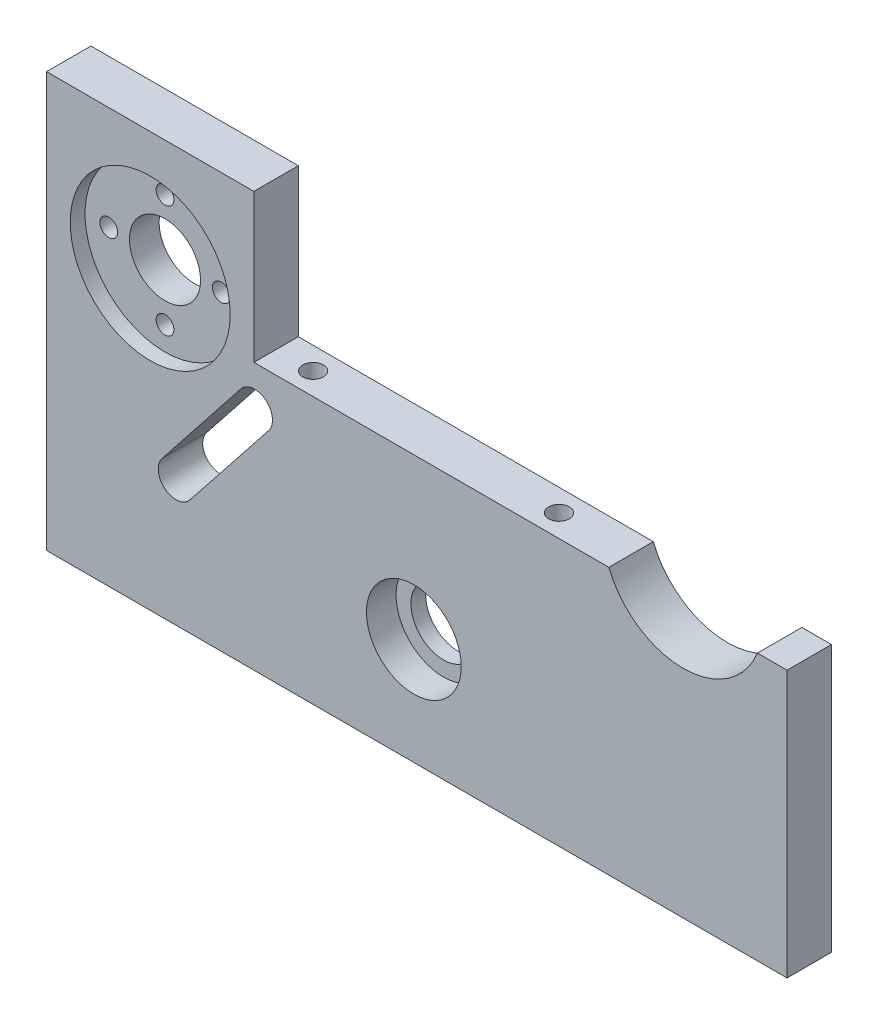
ISO-10303-21;
HEADER;
FILE_DESCRIPTION(('STEP AP214'),'2;1');
FILE_NAME('part.step','',(''),(''),'','','');
FILE_SCHEMA(('AUTOMOTIVE_DESIGN { 1 0 10303 214 1 1 1 1 }'));
ENDSEC;
DATA;
#1=APPLICATION_CONTEXT('core data for automotive mechanical design processes');
#2=APPLICATION_PROTOCOL_DEFINITION('international standard','automotive_design',2000,#1);
#3=PRODUCT_CONTEXT('',#1,'mechanical');
#4=PRODUCT('Part','Part','',(#3));
#5=PRODUCT_RELATED_PRODUCT_CATEGORY('part','',(#4));
#6=PRODUCT_DEFINITION_FORMATION('','',#4);
#7=PRODUCT_DEFINITION_CONTEXT('part definition',#1,'design');
#8=PRODUCT_DEFINITION('design','',#6,#7);
#9=PRODUCT_DEFINITION_SHAPE('','',#8);
#10=(LENGTH_UNIT() NAMED_UNIT(*) SI_UNIT(.MILLI.,.METRE.));
#11=(NAMED_UNIT(*) PLANE_ANGLE_UNIT() SI_UNIT($,.RADIAN.));
#12=(NAMED_UNIT(*) SI_UNIT($,.STERADIAN.) SOLID_ANGLE_UNIT());
#13=UNCERTAINTY_MEASURE_WITH_UNIT(LENGTH_MEASURE(1.E-05),#10,'distance_accuracy_value','');
#14=(GEOMETRIC_REPRESENTATION_CONTEXT(3) GLOBAL_UNCERTAINTY_ASSIGNED_CONTEXT((#13)) GLOBAL_UNIT_ASSIGNED_CONTEXT((#10,
#11,#12)) REPRESENTATION_CONTEXT('',''));
#15=CARTESIAN_POINT('',(0.,0.,0.));
#16=DIRECTION('',(0.,0.,1.));
#17=DIRECTION('',(1.,0.,0.));
#18=AXIS2_PLACEMENT_3D('',#15,#16,#17);
#19=CARTESIAN_POINT('',(71.614420341394,12.6710526315789,7.5));
#20=DIRECTION('',(0.,-1.,0.));
#21=DIRECTION('',(1.,0.,0.));
#22=AXIS2_PLACEMENT_3D('',#19,#20,#21);
#23=PLANE('',#22);
#24=DIRECTION('',(-1.,0.,0.));
#25=VECTOR('',#24,1.);
#26=CARTESIAN_POINT('',(71.614420341394,12.6710526315789,0.));
#27=LINE('',#26,#25);
#28=CARTESIAN_POINT('',(71.614420341394,12.6710526315789,0.));
#29=VERTEX_POINT('',#28);
#30=CARTESIAN_POINT('',(66.614420341394,12.6710526315789,0.));
#31=VERTEX_POINT('',#30);
#32=EDGE_CURVE('E139',#29,#31,#27,.T.);
#33=ORIENTED_EDGE('',*,*,#32,.T.);
#34=DIRECTION('',(0.,0.,1.));
#35=VECTOR('',#34,1.);
#36=CARTESIAN_POINT('',(66.614420341394,12.6710526315789,-0.5));
#37=LINE('',#36,#35);
#38=CARTESIAN_POINT('',(66.614420341394,12.6710526315789,7.5));
#39=VERTEX_POINT('',#38);
#40=EDGE_CURVE('E125',#31,#39,#37,.T.);
#41=ORIENTED_EDGE('',*,*,#40,.T.);
#42=DIRECTION('',(-1.,0.,0.));
#43=VECTOR('',#42,1.);
#44=CARTESIAN_POINT('',(71.614420341394,12.6710526315789,7.5));
#45=LINE('',#44,#43);
#46=CARTESIAN_POINT('',(71.614420341394,12.6710526315789,7.5));
#47=VERTEX_POINT('',#46);
#48=EDGE_CURVE('E137',#47,#39,#45,.T.);
#49=ORIENTED_EDGE('',*,*,#48,.F.);
#50=DIRECTION('',(0.,0.,-1.));
#51=VECTOR('',#50,1.);
#52=CARTESIAN_POINT('',(71.614420341394,12.6710526315789,7.5));
#53=LINE('',#52,#51);
#54=EDGE_CURVE('E173',#47,#29,#53,.T.);
#55=ORIENTED_EDGE('',*,*,#54,.T.);
#56=EDGE_LOOP('',(#33,#41,#49,#55));
#57=FACE_BOUND('',#56,.T.);
#58=ADVANCED_FACE('F33',(#57),#23,.F.);
#59=CARTESIAN_POINT('',(-18.385579658606,37.671052631579,7.5));
#60=DIRECTION('',(0.,-1.,0.));
#61=DIRECTION('',(1.,0.,0.));
#62=AXIS2_PLACEMENT_3D('',#59,#60,#61);
#63=PLANE('',#62);
#64=DIRECTION('',(-1.,0.,0.));
#65=VECTOR('',#64,1.);
#66=CARTESIAN_POINT('',(-18.385579658606,37.671052631579,0.));
#67=LINE('',#66,#65);
#68=CARTESIAN_POINT('',(-18.385579658606,37.671052631579,0.));
#69=VERTEX_POINT('',#68);
#70=CARTESIAN_POINT('',(-53.385579658606,37.6710526315789,0.));
#71=VERTEX_POINT('',#70);
#72=EDGE_CURVE('E154',#69,#71,#67,.T.);
#73=ORIENTED_EDGE('',*,*,#72,.T.);
#74=DIRECTION('',(0.,0.,-1.));
#75=VECTOR('',#74,1.);
#76=CARTESIAN_POINT('',(-53.385579658606,37.6710526315789,7.5));
#77=LINE('',#76,#75);
#78=CARTESIAN_POINT('',(-53.385579658606,37.6710526315789,7.5));
#79=VERTEX_POINT('',#78);
#80=EDGE_CURVE('E181',#79,#71,#77,.T.);
#81=ORIENTED_EDGE('',*,*,#80,.F.);
#82=DIRECTION('',(-1.,0.,0.));
#83=VECTOR('',#82,1.);
#84=CARTESIAN_POINT('',(-18.385579658606,37.671052631579,7.5));
#85=LINE('',#84,#83);
#86=CARTESIAN_POINT('',(-18.385579658606,37.671052631579,7.5));
#87=VERTEX_POINT('',#86);
#88=EDGE_CURVE('E167',#87,#79,#85,.T.);
#89=ORIENTED_EDGE('',*,*,#88,.F.);
#90=DIRECTION('',(0.,0.,-1.));
#91=VECTOR('',#90,1.);
#92=CARTESIAN_POINT('',(-18.385579658606,37.671052631579,7.5));
#93=LINE('',#92,#91);
#94=EDGE_CURVE('E149',#87,#69,#93,.T.);
#95=ORIENTED_EDGE('',*,*,#94,.T.);
#96=EDGE_LOOP('',(#73,#81,#89,#95));
#97=FACE_BOUND('',#96,.T.);
#98=ADVANCED_FACE('F35',(#97),#63,.F.);
#99=CARTESIAN_POINT('',(-53.385579658606,37.6710526315789,7.5));
#100=DIRECTION('',(1.,0.,0.));
#101=DIRECTION('',(0.,0.,-1.));
#102=AXIS2_PLACEMENT_3D('',#99,#100,#101);
#103=PLANE('',#102);
#104=DIRECTION('',(0.,-1.,0.));
#105=VECTOR('',#104,1.);
#106=CARTESIAN_POINT('',(-53.385579658606,37.6710526315789,0.));
#107=LINE('',#106,#105);
#108=CARTESIAN_POINT('',(-53.385579658606,-32.3289473684211,0.));
#109=VERTEX_POINT('',#108);
#110=EDGE_CURVE('E157',#71,#109,#107,.T.);
#111=ORIENTED_EDGE('',*,*,#110,.T.);
#112=DIRECTION('',(0.,0.,-1.));
#113=VECTOR('',#112,1.);
#114=CARTESIAN_POINT('',(-53.385579658606,-32.3289473684211,7.5));
#115=LINE('',#114,#113);
#116=CARTESIAN_POINT('',(-53.385579658606,-32.3289473684211,7.5));
#117=VERTEX_POINT('',#116);
#118=EDGE_CURVE('E178',#117,#109,#115,.T.);
#119=ORIENTED_EDGE('',*,*,#118,.F.);
#120=DIRECTION('',(0.,-1.,0.));
#121=VECTOR('',#120,1.);
#122=CARTESIAN_POINT('',(-53.385579658606,37.6710526315789,7.5));
#123=LINE('',#122,#121);
#124=EDGE_CURVE('E215',#79,#117,#123,.T.);
#125=ORIENTED_EDGE('',*,*,#124,.F.);
#126=ORIENTED_EDGE('',*,*,#80,.T.);
#127=EDGE_LOOP('',(#111,#119,#125,#126));
#128=FACE_BOUND('',#127,.T.);
#129=ADVANCED_FACE('F259',(#128),#103,.F.);
#130=CARTESIAN_POINT('',(-53.385579658606,-32.3289473684211,7.5));
#131=DIRECTION('',(0.,1.,0.));
#132=DIRECTION('',(0.,0.,1.));
#133=AXIS2_PLACEMENT_3D('',#130,#131,#132);
#134=PLANE('',#133);
#135=CARTESIAN_POINT('',(-49.385579658606,-32.3289473684211,3.80027661688586));
#136=DIRECTION('',(0.,-1.,0.));
#137=DIRECTION('',(0.,0.,-1.));
#138=AXIS2_PLACEMENT_3D('',#135,#136,#137);
#139=CIRCLE('',#138,1.75);
#140=CARTESIAN_POINT('',(-49.385579658606,-32.3289473684211,2.05027661688586));
#141=VERTEX_POINT('',#140);
#142=EDGE_CURVE('E285',#141,#141,#139,.T.);
#143=ORIENTED_EDGE('',*,*,#142,.F.);
#144=EDGE_LOOP('',(#143));
#145=FACE_BOUND('',#144,.T.);
#146=CARTESIAN_POINT('',(-17.885579658606,-32.3289473684211,3.80027661688586));
#147=DIRECTION('',(0.,-1.,0.));
#148=DIRECTION('',(0.,0.,-1.));
#149=AXIS2_PLACEMENT_3D('',#146,#147,#148);
#150=CIRCLE('',#149,1.75);
#151=CARTESIAN_POINT('',(-17.885579658606,-32.3289473684211,2.05027661688586));
#152=VERTEX_POINT('',#151);
#153=EDGE_CURVE('E451',#152,#152,#150,.T.);
#154=ORIENTED_EDGE('',*,*,#153,.F.);
#155=EDGE_LOOP('',(#154));
#156=FACE_BOUND('',#155,.T.);
#157=CARTESIAN_POINT('',(36.114420341394,-32.3289473684211,3.80027661688586));
#158=DIRECTION('',(0.,-1.,0.));
#159=DIRECTION('',(0.,0.,-1.));
#160=AXIS2_PLACEMENT_3D('',#157,#158,#159);
#161=CIRCLE('',#160,1.75);
#162=CARTESIAN_POINT('',(36.114420341394,-32.3289473684211,2.05027661688586));
#163=VERTEX_POINT('',#162);
#164=EDGE_CURVE('E459',#163,#163,#161,.T.);
#165=ORIENTED_EDGE('',*,*,#164,.F.);
#166=EDGE_LOOP('',(#165));
#167=FACE_BOUND('',#166,.T.);
#168=CARTESIAN_POINT('',(67.614420341394,-32.3289473684211,3.80027661688586));
#169=DIRECTION('',(0.,-1.,0.));
#170=DIRECTION('',(0.,0.,-1.));
#171=AXIS2_PLACEMENT_3D('',#168,#169,#170);
#172=CIRCLE('',#171,1.75);
#173=CARTESIAN_POINT('',(67.614420341394,-32.3289473684211,2.05027661688587));
#174=VERTEX_POINT('',#173);
#175=EDGE_CURVE('E465',#174,#174,#172,.T.);
#176=ORIENTED_EDGE('',*,*,#175,.F.);
#177=EDGE_LOOP('',(#176));
#178=FACE_BOUND('',#177,.T.);
#179=DIRECTION('',(1.,0.,0.));
#180=VECTOR('',#179,1.);
#181=CARTESIAN_POINT('',(-53.385579658606,-32.3289473684211,0.));
#182=LINE('',#181,#180);
#183=CARTESIAN_POINT('',(71.614420341394,-32.3289473684211,0.));
#184=VERTEX_POINT('',#183);
#185=EDGE_CURVE('E159',#109,#184,#182,.T.);
#186=ORIENTED_EDGE('',*,*,#185,.T.);
#187=DIRECTION('',(0.,0.,-1.));
#188=VECTOR('',#187,1.);
#189=CARTESIAN_POINT('',(71.614420341394,-32.3289473684211,7.5));
#190=LINE('',#189,#188);
#191=CARTESIAN_POINT('',(71.614420341394,-32.3289473684211,7.5));
#192=VERTEX_POINT('',#191);
#193=EDGE_CURVE('E175',#192,#184,#190,.T.);
#194=ORIENTED_EDGE('',*,*,#193,.F.);
#195=DIRECTION('',(1.,0.,0.));
#196=VECTOR('',#195,1.);
#197=CARTESIAN_POINT('',(-53.385579658606,-32.3289473684211,7.5));
#198=LINE('',#197,#196);
#199=EDGE_CURVE('E216',#117,#192,#198,.T.);
#200=ORIENTED_EDGE('',*,*,#199,.F.);
#201=ORIENTED_EDGE('',*,*,#118,.T.);
#202=EDGE_LOOP('',(#186,#194,#200,#201));
#203=FACE_BOUND('',#202,.T.);
#204=ADVANCED_FACE('F221',(#145,#156,#167,#178,#203),#134,.F.);
#205=CARTESIAN_POINT('',(71.614420341394,-32.3289473684211,7.5));
#206=DIRECTION('',(-1.,0.,0.));
#207=DIRECTION('',(0.,0.,1.));
#208=AXIS2_PLACEMENT_3D('',#205,#206,#207);
#209=PLANE('',#208);
#210=DIRECTION('',(0.,1.,0.));
#211=VECTOR('',#210,1.);
#212=CARTESIAN_POINT('',(71.614420341394,-32.3289473684211,0.));
#213=LINE('',#212,#211);
#214=EDGE_CURVE('E161',#184,#29,#213,.T.);
#215=ORIENTED_EDGE('',*,*,#214,.T.);
#216=ORIENTED_EDGE('',*,*,#54,.F.);
#217=DIRECTION('',(0.,1.,0.));
#218=VECTOR('',#217,1.);
#219=CARTESIAN_POINT('',(71.614420341394,-32.3289473684211,7.5));
#220=LINE('',#219,#218);
#221=EDGE_CURVE('E144',#192,#47,#220,.T.);
#222=ORIENTED_EDGE('',*,*,#221,.F.);
#223=ORIENTED_EDGE('',*,*,#193,.T.);
#224=EDGE_LOOP('',(#215,#216,#222,#223));
#225=FACE_BOUND('',#224,.T.);
#226=ADVANCED_FACE('F225',(#225),#209,.F.);
#227=CARTESIAN_POINT('',(-12.135579658606,12.6710526315789,3.75));
#228=DIRECTION('',(0.,1.,0.));
#229=DIRECTION('',(-1.,0.,0.));
#230=AXIS2_PLACEMENT_3D('',#227,#228,#229);
#231=CIRCLE('',#230,1.75);
#232=CARTESIAN_POINT('',(-13.885579658606,12.6710526315789,3.75));
#233=VERTEX_POINT('',#232);
#234=EDGE_CURVE('E274',#233,#233,#231,.T.);
#235=ORIENTED_EDGE('',*,*,#234,.F.);
#236=EDGE_LOOP('',(#235));
#237=FACE_BOUND('',#236,.T.);
#238=CARTESIAN_POINT('',(29.364420341394,12.6710526315789,3.75));
#239=DIRECTION('',(0.,1.,0.));
#240=DIRECTION('',(-1.,0.,0.));
#241=AXIS2_PLACEMENT_3D('',#238,#239,#240);
#242=CIRCLE('',#241,1.75);
#243=CARTESIAN_POINT('',(27.614420341394,12.6710526315789,3.75));
#244=VERTEX_POINT('',#243);
#245=EDGE_CURVE('E277',#244,#244,#242,.T.);
#246=ORIENTED_EDGE('',*,*,#245,.F.);
#247=EDGE_LOOP('',(#246));
#248=FACE_BOUND('',#247,.T.);
#249=CARTESIAN_POINT('',(41.5345479334251,12.6710526315789,7.5));
#250=VERTEX_POINT('',#249);
#251=CARTESIAN_POINT('',(-18.385579658606,12.6710526315789,7.5));
#252=VERTEX_POINT('',#251);
#253=EDGE_CURVE('E147',#250,#252,#45,.T.);
#254=ORIENTED_EDGE('',*,*,#253,.F.);
#255=DIRECTION('',(0.,0.,1.));
#256=VECTOR('',#255,1.);
#257=CARTESIAN_POINT('',(41.5345479334251,12.6710526315789,-0.5));
#258=LINE('',#257,#256);
#259=CARTESIAN_POINT('',(41.5345479334251,12.6710526315789,0.));
#260=VERTEX_POINT('',#259);
#261=EDGE_CURVE('E127',#260,#250,#258,.T.);
#262=ORIENTED_EDGE('',*,*,#261,.F.);
#263=CARTESIAN_POINT('',(-18.385579658606,12.6710526315789,0.));
#264=VERTEX_POINT('',#263);
#265=EDGE_CURVE('E163',#260,#264,#27,.T.);
#266=ORIENTED_EDGE('',*,*,#265,.T.);
#267=DIRECTION('',(0.,0.,-1.));
#268=VECTOR('',#267,1.);
#269=CARTESIAN_POINT('',(-18.385579658606,12.6710526315789,7.5));
#270=LINE('',#269,#268);
#271=EDGE_CURVE('E170',#252,#264,#270,.T.);
#272=ORIENTED_EDGE('',*,*,#271,.F.);
#273=EDGE_LOOP('',(#254,#262,#266,#272));
#274=FACE_BOUND('',#273,.T.);
#275=ADVANCED_FACE('F229',(#237,#248,#274),#23,.F.);
#276=CARTESIAN_POINT('',(-18.385579658606,12.6710526315789,7.5));
#277=DIRECTION('',(-1.,0.,0.));
#278=DIRECTION('',(0.,-1.,0.));
#279=AXIS2_PLACEMENT_3D('',#276,#277,#278);
#280=PLANE('',#279);
#281=DIRECTION('',(0.,1.,0.));
#282=VECTOR('',#281,1.);
#283=CARTESIAN_POINT('',(-18.385579658606,12.6710526315789,0.));
#284=LINE('',#283,#282);
#285=EDGE_CURVE('E165',#264,#69,#284,.T.);
#286=ORIENTED_EDGE('',*,*,#285,.T.);
#287=ORIENTED_EDGE('',*,*,#94,.F.);
#288=DIRECTION('',(0.,1.,0.));
#289=VECTOR('',#288,1.);
#290=CARTESIAN_POINT('',(-18.385579658606,12.6710526315789,7.5));
#291=LINE('',#290,#289);
#292=EDGE_CURVE('E146',#252,#87,#291,.T.);
#293=ORIENTED_EDGE('',*,*,#292,.F.);
#294=ORIENTED_EDGE('',*,*,#271,.T.);
#295=EDGE_LOOP('',(#286,#287,#293,#294));
#296=FACE_BOUND('',#295,.T.);
#297=ADVANCED_FACE('F264',(#296),#280,.F.);
#298=CARTESIAN_POINT('',(0.,0.,7.5));
#299=DIRECTION('',(0.,0.,1.));
#300=DIRECTION('',(1.,0.,0.));
#301=AXIS2_PLACEMENT_3D('',#298,#299,#300);
#302=PLANE('',#301);
#303=CARTESIAN_POINT('',(-35.885579658606,17.671052631579,7.5));
#304=DIRECTION('',(0.,0.,1.));
#305=DIRECTION('',(1.,0.,0.));
#306=AXIS2_PLACEMENT_3D('',#303,#304,#305);
#307=CIRCLE('',#306,13.5);
#308=CARTESIAN_POINT('',(-22.385579658606,17.671052631579,7.5));
#309=VERTEX_POINT('',#308);
#310=EDGE_CURVE('E293',#309,#309,#307,.T.);
#311=ORIENTED_EDGE('',*,*,#310,.F.);
#312=EDGE_LOOP('',(#311));
#313=FACE_BOUND('',#312,.T.);
#314=CARTESIAN_POINT('',(8.61442034139401,-14.3289473684211,7.5));
#315=DIRECTION('',(0.,0.,1.));
#316=DIRECTION('',(1.,0.,0.));
#317=AXIS2_PLACEMENT_3D('',#314,#315,#316);
#318=CIRCLE('',#317,8.);
#319=CARTESIAN_POINT('',(16.614420341394,-14.3289473684211,7.5));
#320=VERTEX_POINT('',#319);
#321=EDGE_CURVE('E330',#320,#320,#318,.T.);
#322=ORIENTED_EDGE('',*,*,#321,.F.);
#323=EDGE_LOOP('',(#322));
#324=FACE_BOUND('',#323,.T.);
#325=CARTESIAN_POINT('',(54.0744841374096,17.671052631579,7.5));
#326=DIRECTION('',(0.,0.,1.));
#327=DIRECTION('',(-1.,0.,0.));
#328=AXIS2_PLACEMENT_3D('',#325,#326,#327);
#329=CIRCLE('',#328,13.5);
#330=EDGE_CURVE('E122',#250,#39,#329,.T.);
#331=ORIENTED_EDGE('',*,*,#330,.F.);
#332=ORIENTED_EDGE('',*,*,#253,.T.);
#333=ORIENTED_EDGE('',*,*,#292,.T.);
#334=ORIENTED_EDGE('',*,*,#88,.T.);
#335=ORIENTED_EDGE('',*,*,#124,.T.);
#336=ORIENTED_EDGE('',*,*,#199,.T.);
#337=ORIENTED_EDGE('',*,*,#221,.T.);
#338=ORIENTED_EDGE('',*,*,#48,.T.);
#339=EDGE_LOOP('',(#331,#332,#333,#334,#335,#336,#337,#338));
#340=FACE_BOUND('',#339,.T.);
#341=CARTESIAN_POINT('',(-18.2462864107044,5.81780585686629,7.5));
#342=DIRECTION('',(0.,0.,1.));
#343=DIRECTION('',(-1.,0.,0.));
#344=AXIS2_PLACEMENT_3D('',#341,#342,#343);
#345=CIRCLE('',#344,3.);
#346=CARTESIAN_POINT('',(-15.8930396359917,3.95709910476791,7.5));
#347=VERTEX_POINT('',#346);
#348=CARTESIAN_POINT('',(-20.599533185417,7.67851260896467,7.5));
#349=VERTEX_POINT('',#348);
#350=EDGE_CURVE('E48',#347,#349,#345,.T.);
#351=ORIENTED_EDGE('',*,*,#350,.F.);
#352=DIRECTION('',(0.620235584032793,0.784415591570884,0.));
#353=VECTOR('',#352,1.);
#354=CARTESIAN_POINT('',(-15.8930396359917,3.95709910476791,7.5));
#355=LINE('',#354,#353);
#356=CARTESIAN_POINT('',(-29.171626131795,-12.8364073458068,7.5));
#357=VERTEX_POINT('',#356);
#358=EDGE_CURVE('E204',#357,#347,#355,.T.);
#359=ORIENTED_EDGE('',*,*,#358,.F.);
#360=CARTESIAN_POINT('',(-31.5248729065076,-10.9757005937084,7.5));
#361=DIRECTION('',(0.,0.,1.));
#362=DIRECTION('',(1.,0.,0.));
#363=AXIS2_PLACEMENT_3D('',#360,#361,#362);
#364=CIRCLE('',#363,3.);
#365=CARTESIAN_POINT('',(-33.8781196812203,-9.11499384161005,7.5));
#366=VERTEX_POINT('',#365);
#367=EDGE_CURVE('E237',#366,#357,#364,.T.);
#368=ORIENTED_EDGE('',*,*,#367,.F.);
#369=DIRECTION('',(-0.620235584032793,-0.784415591570884,0.));
#370=VECTOR('',#369,1.);
#371=CARTESIAN_POINT('',(-20.599533185417,7.67851260896467,7.5));
#372=LINE('',#371,#370);
#373=EDGE_CURVE('E235',#349,#366,#372,.T.);
#374=ORIENTED_EDGE('',*,*,#373,.F.);
#375=EDGE_LOOP('',(#351,#359,#368,#374));
#376=FACE_BOUND('',#375,.T.);
#377=ADVANCED_FACE('F141',(#313,#324,#340,#376),#302,.T.);
#378=CARTESIAN_POINT('',(0.,0.,0.));
#379=DIRECTION('',(0.,0.,1.));
#380=DIRECTION('',(1.,0.,0.));
#381=AXIS2_PLACEMENT_3D('',#378,#379,#380);
#382=PLANE('',#381);
#383=CARTESIAN_POINT('',(-26.385579658606,17.671052631579,0.));
#384=DIRECTION('',(0.,0.,-1.));
#385=DIRECTION('',(-1.,0.,0.));
#386=AXIS2_PLACEMENT_3D('',#383,#384,#385);
#387=CIRCLE('',#386,1.5);
#388=CARTESIAN_POINT('',(-27.885579658606,17.671052631579,0.));
#389=VERTEX_POINT('',#388);
#390=EDGE_CURVE('E300',#389,#389,#387,.T.);
#391=ORIENTED_EDGE('',*,*,#390,.F.);
#392=EDGE_LOOP('',(#391));
#393=FACE_BOUND('',#392,.T.);
#394=CARTESIAN_POINT('',(-35.885579658606,17.671052631579,0.));
#395=DIRECTION('',(0.,0.,-1.));
#396=DIRECTION('',(-1.,0.,0.));
#397=AXIS2_PLACEMENT_3D('',#394,#395,#396);
#398=CIRCLE('',#397,6.);
#399=CARTESIAN_POINT('',(-41.885579658606,17.671052631579,0.));
#400=VERTEX_POINT('',#399);
#401=EDGE_CURVE('E313',#400,#400,#398,.T.);
#402=ORIENTED_EDGE('',*,*,#401,.F.);
#403=EDGE_LOOP('',(#402));
#404=FACE_BOUND('',#403,.T.);
#405=CARTESIAN_POINT('',(-35.885579658606,8.17105263157895,0.));
#406=DIRECTION('',(0.,0.,-1.));
#407=DIRECTION('',(-1.,0.,0.));
#408=AXIS2_PLACEMENT_3D('',#405,#406,#407);
#409=CIRCLE('',#408,1.5);
#410=CARTESIAN_POINT('',(-37.385579658606,8.17105263157895,0.));
#411=VERTEX_POINT('',#410);
#412=EDGE_CURVE('E309',#411,#411,#409,.T.);
#413=ORIENTED_EDGE('',*,*,#412,.F.);
#414=EDGE_LOOP('',(#413));
#415=FACE_BOUND('',#414,.T.);
#416=CARTESIAN_POINT('',(-45.385579658606,17.671052631579,0.));
#417=DIRECTION('',(0.,0.,-1.));
#418=DIRECTION('',(-1.,0.,0.));
#419=AXIS2_PLACEMENT_3D('',#416,#417,#418);
#420=CIRCLE('',#419,1.5);
#421=CARTESIAN_POINT('',(-46.885579658606,17.671052631579,0.));
#422=VERTEX_POINT('',#421);
#423=EDGE_CURVE('E312',#422,#422,#420,.T.);
#424=ORIENTED_EDGE('',*,*,#423,.F.);
#425=EDGE_LOOP('',(#424));
#426=FACE_BOUND('',#425,.T.);
#427=CARTESIAN_POINT('',(-35.8855796586061,27.171052631579,0.));
#428=DIRECTION('',(0.,0.,-1.));
#429=DIRECTION('',(-1.,0.,0.));
#430=AXIS2_PLACEMENT_3D('',#427,#428,#429);
#431=CIRCLE('',#430,1.5);
#432=CARTESIAN_POINT('',(-37.3855796586061,27.171052631579,0.));
#433=VERTEX_POINT('',#432);
#434=EDGE_CURVE('E304',#433,#433,#431,.T.);
#435=ORIENTED_EDGE('',*,*,#434,.F.);
#436=EDGE_LOOP('',(#435));
#437=FACE_BOUND('',#436,.T.);
#438=CARTESIAN_POINT('',(8.61442034139401,-14.3289473684211,0.));
#439=DIRECTION('',(0.,0.,-1.));
#440=DIRECTION('',(-1.,0.,0.));
#441=AXIS2_PLACEMENT_3D('',#438,#439,#440);
#442=CIRCLE('',#441,5.5);
#443=CARTESIAN_POINT('',(3.11442034139401,-14.3289473684211,0.));
#444=VERTEX_POINT('',#443);
#445=EDGE_CURVE('E303',#444,#444,#442,.T.);
#446=ORIENTED_EDGE('',*,*,#445,.F.);
#447=EDGE_LOOP('',(#446));
#448=FACE_BOUND('',#447,.T.);
#449=DIRECTION('',(0.620235584032793,0.784415591570884,0.));
#450=VECTOR('',#449,1.);
#451=CARTESIAN_POINT('',(-11.7043291774108,9.25458586120852,0.));
#452=LINE('',#451,#450);
#453=CARTESIAN_POINT('',(-29.171626131795,-12.8364073458068,0.));
#454=VERTEX_POINT('',#453);
#455=CARTESIAN_POINT('',(-15.8930396359917,3.95709910476791,0.));
#456=VERTEX_POINT('',#455);
#457=EDGE_CURVE('E190',#454,#456,#452,.T.);
#458=ORIENTED_EDGE('',*,*,#457,.T.);
#459=CARTESIAN_POINT('',(-18.2462864107044,5.81780585686629,0.));
#460=DIRECTION('',(0.,0.,1.));
#461=DIRECTION('',(1.,0.,0.));
#462=AXIS2_PLACEMENT_3D('',#459,#460,#461);
#463=CIRCLE('',#462,3.);
#464=CARTESIAN_POINT('',(-20.599533185417,7.67851260896467,0.));
#465=VERTEX_POINT('',#464);
#466=EDGE_CURVE('E41',#456,#465,#463,.T.);
#467=ORIENTED_EDGE('',*,*,#466,.T.);
#468=DIRECTION('',(-0.620235584032793,-0.784415591570884,0.));
#469=VECTOR('',#468,1.);
#470=CARTESIAN_POINT('',(-16.4108227268361,12.9759993654053,0.));
#471=LINE('',#470,#469);
#472=CARTESIAN_POINT('',(-33.8781196812203,-9.11499384161005,0.));
#473=VERTEX_POINT('',#472);
#474=EDGE_CURVE('E184',#465,#473,#471,.T.);
#475=ORIENTED_EDGE('',*,*,#474,.T.);
#476=CARTESIAN_POINT('',(-31.5248729065076,-10.9757005937084,0.));
#477=DIRECTION('',(0.,0.,1.));
#478=DIRECTION('',(1.,0.,0.));
#479=AXIS2_PLACEMENT_3D('',#476,#477,#478);
#480=CIRCLE('',#479,3.);
#481=EDGE_CURVE('E187',#473,#454,#480,.T.);
#482=ORIENTED_EDGE('',*,*,#481,.T.);
#483=EDGE_LOOP('',(#458,#467,#475,#482));
#484=FACE_BOUND('',#483,.T.);
#485=ORIENTED_EDGE('',*,*,#265,.F.);
#486=CARTESIAN_POINT('',(54.0744841374096,17.671052631579,0.));
#487=DIRECTION('',(0.,0.,1.));
#488=DIRECTION('',(1.,0.,0.));
#489=AXIS2_PLACEMENT_3D('',#486,#487,#488);
#490=CIRCLE('',#489,13.5);
#491=EDGE_CURVE('E11',#260,#31,#490,.T.);
#492=ORIENTED_EDGE('',*,*,#491,.T.);
#493=ORIENTED_EDGE('',*,*,#32,.F.);
#494=ORIENTED_EDGE('',*,*,#214,.F.);
#495=ORIENTED_EDGE('',*,*,#185,.F.);
#496=ORIENTED_EDGE('',*,*,#110,.F.);
#497=ORIENTED_EDGE('',*,*,#72,.F.);
#498=ORIENTED_EDGE('',*,*,#285,.F.);
#499=EDGE_LOOP('',(#485,#492,#493,#494,#495,#496,#497,#498));
#500=FACE_BOUND('',#499,.T.);
#501=ADVANCED_FACE('F194',(#393,#404,#415,#426,#437,#448,#484,#500),#382,.F.);
#502=CARTESIAN_POINT('',(-18.2462864107044,5.81780585686629,-0.5));
#503=DIRECTION('',(0.,0.,1.));
#504=DIRECTION('',(1.,0.,0.));
#505=AXIS2_PLACEMENT_3D('',#502,#503,#504);
#506=CYLINDRICAL_SURFACE('',#505,3.);
#507=DIRECTION('',(0.,0.,1.));
#508=VECTOR('',#507,1.);
#509=CARTESIAN_POINT('',(-15.8930396359917,3.95709910476791,-0.5));
#510=LINE('',#509,#508);
#511=EDGE_CURVE('E131',#456,#347,#510,.T.);
#512=ORIENTED_EDGE('',*,*,#511,.T.);
#513=ORIENTED_EDGE('',*,*,#350,.T.);
#514=DIRECTION('',(0.,0.,1.));
#515=VECTOR('',#514,1.);
#516=CARTESIAN_POINT('',(-20.599533185417,7.67851260896467,-0.5));
#517=LINE('',#516,#515);
#518=EDGE_CURVE('E199',#465,#349,#517,.T.);
#519=ORIENTED_EDGE('',*,*,#518,.F.);
#520=ORIENTED_EDGE('',*,*,#466,.F.);
#521=EDGE_LOOP('',(#512,#513,#519,#520));
#522=FACE_BOUND('',#521,.T.);
#523=ADVANCED_FACE('F197',(#522),#506,.F.);
#524=CARTESIAN_POINT('',(-15.8930396359917,3.95709910476791,-0.5));
#525=DIRECTION('',(0.784415591570884,-0.620235584032793,0.));
#526=DIRECTION('',(0.620235584032793,0.784415591570884,0.));
#527=AXIS2_PLACEMENT_3D('',#524,#525,#526);
#528=PLANE('',#527);
#529=DIRECTION('',(0.,0.,1.));
#530=VECTOR('',#529,1.);
#531=CARTESIAN_POINT('',(-29.171626131795,-12.8364073458068,-0.5));
#532=LINE('',#531,#530);
#533=EDGE_CURVE('E205',#454,#357,#532,.T.);
#534=ORIENTED_EDGE('',*,*,#533,.T.);
#535=ORIENTED_EDGE('',*,*,#358,.T.);
#536=ORIENTED_EDGE('',*,*,#511,.F.);
#537=ORIENTED_EDGE('',*,*,#457,.F.);
#538=EDGE_LOOP('',(#534,#535,#536,#537));
#539=FACE_BOUND('',#538,.T.);
#540=ADVANCED_FACE('F201',(#539),#528,.F.);
#541=CARTESIAN_POINT('',(-31.5248729065076,-10.9757005937084,-0.5));
#542=DIRECTION('',(0.,0.,1.));
#543=DIRECTION('',(1.,0.,0.));
#544=AXIS2_PLACEMENT_3D('',#541,#542,#543);
#545=CYLINDRICAL_SURFACE('',#544,3.);
#546=DIRECTION('',(0.,0.,1.));
#547=VECTOR('',#546,1.);
#548=CARTESIAN_POINT('',(-33.8781196812203,-9.11499384161005,-0.5));
#549=LINE('',#548,#547);
#550=EDGE_CURVE('E56',#473,#366,#549,.T.);
#551=ORIENTED_EDGE('',*,*,#550,.T.);
#552=ORIENTED_EDGE('',*,*,#367,.T.);
#553=ORIENTED_EDGE('',*,*,#533,.F.);
#554=ORIENTED_EDGE('',*,*,#481,.F.);
#555=EDGE_LOOP('',(#551,#552,#553,#554));
#556=FACE_BOUND('',#555,.T.);
#557=ADVANCED_FACE('F241',(#556),#545,.F.);
#558=CARTESIAN_POINT('',(-20.599533185417,7.67851260896467,-0.5));
#559=DIRECTION('',(-0.784415591570884,0.620235584032793,0.));
#560=DIRECTION('',(-0.620235584032793,-0.784415591570884,0.));
#561=AXIS2_PLACEMENT_3D('',#558,#559,#560);
#562=PLANE('',#561);
#563=ORIENTED_EDGE('',*,*,#518,.T.);
#564=ORIENTED_EDGE('',*,*,#373,.T.);
#565=ORIENTED_EDGE('',*,*,#550,.F.);
#566=ORIENTED_EDGE('',*,*,#474,.F.);
#567=EDGE_LOOP('',(#563,#564,#565,#566));
#568=FACE_BOUND('',#567,.T.);
#569=ADVANCED_FACE('F243',(#568),#562,.F.);
#570=CARTESIAN_POINT('',(54.0744841374096,17.671052631579,-0.5));
#571=DIRECTION('',(0.,0.,1.));
#572=DIRECTION('',(1.,0.,0.));
#573=AXIS2_PLACEMENT_3D('',#570,#571,#572);
#574=CYLINDRICAL_SURFACE('',#573,13.5);
#575=ORIENTED_EDGE('',*,*,#261,.T.);
#576=ORIENTED_EDGE('',*,*,#330,.T.);
#577=ORIENTED_EDGE('',*,*,#40,.F.);
#578=ORIENTED_EDGE('',*,*,#491,.F.);
#579=EDGE_LOOP('',(#575,#576,#577,#578));
#580=FACE_BOUND('',#579,.T.);
#581=ADVANCED_FACE('F124',(#580),#574,.F.);
#582=CARTESIAN_POINT('',(8.61442034139401,-14.3289473684211,2.5));
#583=DIRECTION('',(0.,0.,1.));
#584=DIRECTION('',(1.,0.,0.));
#585=AXIS2_PLACEMENT_3D('',#582,#583,#584);
#586=CYLINDRICAL_SURFACE('',#585,8.);
#587=CARTESIAN_POINT('',(8.61442034139401,-14.3289473684211,2.5));
#588=DIRECTION('',(0.,0.,1.));
#589=DIRECTION('',(1.,0.,0.));
#590=AXIS2_PLACEMENT_3D('',#587,#588,#589);
#591=CIRCLE('',#590,8.);
#592=CARTESIAN_POINT('',(16.614420341394,-14.3289473684211,2.5));
#593=VERTEX_POINT('',#592);
#594=EDGE_CURVE('E236',#593,#593,#591,.T.);
#595=ORIENTED_EDGE('',*,*,#594,.F.);
#596=EDGE_LOOP('',(#595));
#597=FACE_BOUND('',#596,.T.);
#598=ORIENTED_EDGE('',*,*,#321,.T.);
#599=EDGE_LOOP('',(#598));
#600=FACE_BOUND('',#599,.T.);
#601=ADVANCED_FACE('F250',(#597,#600),#586,.F.);
#602=CARTESIAN_POINT('',(8.61442034139401,-14.3289473684211,2.5));
#603=DIRECTION('',(0.,0.,1.));
#604=DIRECTION('',(1.,0.,0.));
#605=AXIS2_PLACEMENT_3D('',#602,#603,#604);
#606=PLANE('',#605);
#607=CARTESIAN_POINT('',(8.61442034139401,-14.3289473684211,2.5));
#608=DIRECTION('',(0.,0.,-1.));
#609=DIRECTION('',(-1.,0.,0.));
#610=AXIS2_PLACEMENT_3D('',#607,#608,#609);
#611=CIRCLE('',#610,5.5);
#612=CARTESIAN_POINT('',(3.11442034139401,-14.3289473684211,2.5));
#613=VERTEX_POINT('',#612);
#614=EDGE_CURVE('E327',#613,#613,#611,.T.);
#615=ORIENTED_EDGE('',*,*,#614,.T.);
#616=EDGE_LOOP('',(#615));
#617=FACE_BOUND('',#616,.T.);
#618=ORIENTED_EDGE('',*,*,#594,.T.);
#619=EDGE_LOOP('',(#618));
#620=FACE_BOUND('',#619,.T.);
#621=ADVANCED_FACE('F357',(#617,#620),#606,.T.);
#622=CARTESIAN_POINT('',(8.61442034139401,-14.3289473684211,2.5));
#623=DIRECTION('',(0.,0.,-1.));
#624=DIRECTION('',(-1.,0.,0.));
#625=AXIS2_PLACEMENT_3D('',#622,#623,#624);
#626=CYLINDRICAL_SURFACE('',#625,5.5);
#627=ORIENTED_EDGE('',*,*,#614,.F.);
#628=EDGE_LOOP('',(#627));
#629=FACE_BOUND('',#628,.T.);
#630=ORIENTED_EDGE('',*,*,#445,.T.);
#631=EDGE_LOOP('',(#630));
#632=FACE_BOUND('',#631,.T.);
#633=ADVANCED_FACE('F361',(#629,#632),#626,.F.);
#634=CARTESIAN_POINT('',(-35.8855796586061,27.171052631579,5.));
#635=DIRECTION('',(0.,0.,-1.));
#636=DIRECTION('',(-1.,0.,0.));
#637=AXIS2_PLACEMENT_3D('',#634,#635,#636);
#638=CYLINDRICAL_SURFACE('',#637,1.5);
#639=CARTESIAN_POINT('',(-35.8855796586061,27.171052631579,5.));
#640=DIRECTION('',(0.,0.,-1.));
#641=DIRECTION('',(-1.,0.,0.));
#642=AXIS2_PLACEMENT_3D('',#639,#640,#641);
#643=CIRCLE('',#642,1.5);
#644=CARTESIAN_POINT('',(-37.3855796586061,27.171052631579,5.));
#645=VERTEX_POINT('',#644);
#646=EDGE_CURVE('E318',#645,#645,#643,.T.);
#647=ORIENTED_EDGE('',*,*,#646,.F.);
#648=EDGE_LOOP('',(#647));
#649=FACE_BOUND('',#648,.T.);
#650=ORIENTED_EDGE('',*,*,#434,.T.);
#651=EDGE_LOOP('',(#650));
#652=FACE_BOUND('',#651,.T.);
#653=ADVANCED_FACE('F365',(#649,#652),#638,.F.);
#654=CARTESIAN_POINT('',(-45.385579658606,17.671052631579,5.));
#655=DIRECTION('',(0.,0.,-1.));
#656=DIRECTION('',(-1.,0.,0.));
#657=AXIS2_PLACEMENT_3D('',#654,#655,#656);
#658=CYLINDRICAL_SURFACE('',#657,1.5);
#659=CARTESIAN_POINT('',(-45.385579658606,17.671052631579,5.));
#660=DIRECTION('',(0.,0.,-1.));
#661=DIRECTION('',(-1.,0.,0.));
#662=AXIS2_PLACEMENT_3D('',#659,#660,#661);
#663=CIRCLE('',#662,1.5);
#664=CARTESIAN_POINT('',(-46.885579658606,17.671052631579,5.));
#665=VERTEX_POINT('',#664);
#666=EDGE_CURVE('E308',#665,#665,#663,.T.);
#667=ORIENTED_EDGE('',*,*,#666,.F.);
#668=EDGE_LOOP('',(#667));
#669=FACE_BOUND('',#668,.T.);
#670=ORIENTED_EDGE('',*,*,#423,.T.);
#671=EDGE_LOOP('',(#670));
#672=FACE_BOUND('',#671,.T.);
#673=ADVANCED_FACE('F367',(#669,#672),#658,.F.);
#674=CARTESIAN_POINT('',(-35.885579658606,8.17105263157895,5.));
#675=DIRECTION('',(0.,0.,-1.));
#676=DIRECTION('',(-1.,0.,0.));
#677=AXIS2_PLACEMENT_3D('',#674,#675,#676);
#678=CYLINDRICAL_SURFACE('',#677,1.5);
#679=CARTESIAN_POINT('',(-35.885579658606,8.17105263157895,5.));
#680=DIRECTION('',(0.,0.,-1.));
#681=DIRECTION('',(-1.,0.,0.));
#682=AXIS2_PLACEMENT_3D('',#679,#680,#681);
#683=CIRCLE('',#682,1.5);
#684=CARTESIAN_POINT('',(-37.385579658606,8.17105263157895,5.));
#685=VERTEX_POINT('',#684);
#686=EDGE_CURVE('E305',#685,#685,#683,.T.);
#687=ORIENTED_EDGE('',*,*,#686,.F.);
#688=EDGE_LOOP('',(#687));
#689=FACE_BOUND('',#688,.T.);
#690=ORIENTED_EDGE('',*,*,#412,.T.);
#691=EDGE_LOOP('',(#690));
#692=FACE_BOUND('',#691,.T.);
#693=ADVANCED_FACE('F370',(#689,#692),#678,.F.);
#694=CARTESIAN_POINT('',(-35.885579658606,17.671052631579,5.));
#695=DIRECTION('',(0.,0.,-1.));
#696=DIRECTION('',(-1.,0.,0.));
#697=AXIS2_PLACEMENT_3D('',#694,#695,#696);
#698=CYLINDRICAL_SURFACE('',#697,6.);
#699=CARTESIAN_POINT('',(-35.885579658606,17.671052631579,5.));
#700=DIRECTION('',(0.,0.,-1.));
#701=DIRECTION('',(-1.,0.,0.));
#702=AXIS2_PLACEMENT_3D('',#699,#700,#701);
#703=CIRCLE('',#702,6.);
#704=CARTESIAN_POINT('',(-41.885579658606,17.671052631579,5.));
#705=VERTEX_POINT('',#704);
#706=EDGE_CURVE('E299',#705,#705,#703,.T.);
#707=ORIENTED_EDGE('',*,*,#706,.F.);
#708=EDGE_LOOP('',(#707));
#709=FACE_BOUND('',#708,.T.);
#710=ORIENTED_EDGE('',*,*,#401,.T.);
#711=EDGE_LOOP('',(#710));
#712=FACE_BOUND('',#711,.T.);
#713=ADVANCED_FACE('F375',(#709,#712),#698,.F.);
#714=CARTESIAN_POINT('',(-26.385579658606,17.671052631579,5.));
#715=DIRECTION('',(0.,0.,-1.));
#716=DIRECTION('',(-1.,0.,0.));
#717=AXIS2_PLACEMENT_3D('',#714,#715,#716);
#718=CYLINDRICAL_SURFACE('',#717,1.5);
#719=CARTESIAN_POINT('',(-26.385579658606,17.671052631579,5.));
#720=DIRECTION('',(0.,0.,-1.));
#721=DIRECTION('',(-1.,0.,0.));
#722=AXIS2_PLACEMENT_3D('',#719,#720,#721);
#723=CIRCLE('',#722,1.5);
#724=CARTESIAN_POINT('',(-27.885579658606,17.671052631579,5.));
#725=VERTEX_POINT('',#724);
#726=EDGE_CURVE('E292',#725,#725,#723,.T.);
#727=ORIENTED_EDGE('',*,*,#726,.F.);
#728=EDGE_LOOP('',(#727));
#729=FACE_BOUND('',#728,.T.);
#730=ORIENTED_EDGE('',*,*,#390,.T.);
#731=EDGE_LOOP('',(#730));
#732=FACE_BOUND('',#731,.T.);
#733=ADVANCED_FACE('F378',(#729,#732),#718,.F.);
#734=CARTESIAN_POINT('',(-35.885579658606,17.671052631579,5.));
#735=DIRECTION('',(0.,0.,1.));
#736=DIRECTION('',(1.,0.,0.));
#737=AXIS2_PLACEMENT_3D('',#734,#735,#736);
#738=PLANE('',#737);
#739=CARTESIAN_POINT('',(-35.885579658606,17.671052631579,5.));
#740=DIRECTION('',(0.,0.,1.));
#741=DIRECTION('',(1.,0.,0.));
#742=AXIS2_PLACEMENT_3D('',#739,#740,#741);
#743=CIRCLE('',#742,13.5);
#744=CARTESIAN_POINT('',(-22.385579658606,17.671052631579,5.));
#745=VERTEX_POINT('',#744);
#746=EDGE_CURVE('E289',#745,#745,#743,.T.);
#747=ORIENTED_EDGE('',*,*,#746,.T.);
#748=EDGE_LOOP('',(#747));
#749=FACE_BOUND('',#748,.T.);
#750=ORIENTED_EDGE('',*,*,#726,.T.);
#751=EDGE_LOOP('',(#750));
#752=FACE_BOUND('',#751,.T.);
#753=ORIENTED_EDGE('',*,*,#706,.T.);
#754=EDGE_LOOP('',(#753));
#755=FACE_BOUND('',#754,.T.);
#756=ORIENTED_EDGE('',*,*,#686,.T.);
#757=EDGE_LOOP('',(#756));
#758=FACE_BOUND('',#757,.T.);
#759=ORIENTED_EDGE('',*,*,#666,.T.);
#760=EDGE_LOOP('',(#759));
#761=FACE_BOUND('',#760,.T.);
#762=ORIENTED_EDGE('',*,*,#646,.T.);
#763=EDGE_LOOP('',(#762));
#764=FACE_BOUND('',#763,.T.);
#765=ADVANCED_FACE('F385',(#749,#752,#755,#758,#761,#764),#738,.T.);
#766=CARTESIAN_POINT('',(-35.885579658606,17.671052631579,5.));
#767=DIRECTION('',(0.,0.,1.));
#768=DIRECTION('',(1.,0.,0.));
#769=AXIS2_PLACEMENT_3D('',#766,#767,#768);
#770=CYLINDRICAL_SURFACE('',#769,13.5);
#771=ORIENTED_EDGE('',*,*,#746,.F.);
#772=EDGE_LOOP('',(#771));
#773=FACE_BOUND('',#772,.T.);
#774=ORIENTED_EDGE('',*,*,#310,.T.);
#775=EDGE_LOOP('',(#774));
#776=FACE_BOUND('',#775,.T.);
#777=ADVANCED_FACE('F387',(#773,#776),#770,.F.);
#778=CARTESIAN_POINT('',(29.364420341394,5.67105263157893,3.75));
#779=DIRECTION('',(0.,1.,0.));
#780=DIRECTION('',(-1.,0.,0.));
#781=AXIS2_PLACEMENT_3D('',#778,#779,#780);
#782=CYLINDRICAL_SURFACE('',#781,1.75);
#783=CARTESIAN_POINT('',(29.364420341394,5.67105263157893,3.75));
#784=DIRECTION('',(0.,1.,0.));
#785=DIRECTION('',(-1.,0.,0.));
#786=AXIS2_PLACEMENT_3D('',#783,#784,#785);
#787=CIRCLE('',#786,1.75);
#788=CARTESIAN_POINT('',(27.614420341394,5.67105263157893,3.75));
#789=VERTEX_POINT('',#788);
#790=EDGE_CURVE('E279',#789,#789,#787,.T.);
#791=ORIENTED_EDGE('',*,*,#790,.F.);
#792=EDGE_LOOP('',(#791));
#793=FACE_BOUND('',#792,.T.);
#794=ORIENTED_EDGE('',*,*,#245,.T.);
#795=EDGE_LOOP('',(#794));
#796=FACE_BOUND('',#795,.T.);
#797=ADVANCED_FACE('F390',(#793,#796),#782,.F.);
#798=CARTESIAN_POINT('',(29.364420341394,5.67105263157893,3.75));
#799=DIRECTION('',(0.,1.,0.));
#800=DIRECTION('',(-1.,0.,0.));
#801=AXIS2_PLACEMENT_3D('',#798,#799,#800);
#802=PLANE('',#801);
#803=ORIENTED_EDGE('',*,*,#790,.T.);
#804=EDGE_LOOP('',(#803));
#805=FACE_BOUND('',#804,.T.);
#806=ADVANCED_FACE('F397',(#805),#802,.T.);
#807=CARTESIAN_POINT('',(-12.135579658606,5.67105263157893,3.75));
#808=DIRECTION('',(0.,1.,0.));
#809=DIRECTION('',(-1.,0.,0.));
#810=AXIS2_PLACEMENT_3D('',#807,#808,#809);
#811=CYLINDRICAL_SURFACE('',#810,1.75);
#812=CARTESIAN_POINT('',(-12.135579658606,5.67105263157893,3.75));
#813=DIRECTION('',(0.,1.,0.));
#814=DIRECTION('',(-1.,0.,0.));
#815=AXIS2_PLACEMENT_3D('',#812,#813,#814);
#816=CIRCLE('',#815,1.75);
#817=CARTESIAN_POINT('',(-13.885579658606,5.67105263157893,3.75));
#818=VERTEX_POINT('',#817);
#819=EDGE_CURVE('E296',#818,#818,#816,.T.);
#820=ORIENTED_EDGE('',*,*,#819,.F.);
#821=EDGE_LOOP('',(#820));
#822=FACE_BOUND('',#821,.T.);
#823=ORIENTED_EDGE('',*,*,#234,.T.);
#824=EDGE_LOOP('',(#823));
#825=FACE_BOUND('',#824,.T.);
#826=ADVANCED_FACE('F401',(#822,#825),#811,.F.);
#827=CARTESIAN_POINT('',(-12.135579658606,5.67105263157893,3.75));
#828=DIRECTION('',(0.,1.,0.));
#829=DIRECTION('',(-1.,0.,0.));
#830=AXIS2_PLACEMENT_3D('',#827,#828,#829);
#831=PLANE('',#830);
#832=ORIENTED_EDGE('',*,*,#819,.T.);
#833=EDGE_LOOP('',(#832));
#834=FACE_BOUND('',#833,.T.);
#835=ADVANCED_FACE('F405',(#834),#831,.T.);
#836=CARTESIAN_POINT('',(67.614420341394,-25.3289473684211,3.80027661688586));
#837=DIRECTION('',(0.,-1.,0.));
#838=DIRECTION('',(0.,0.,-1.));
#839=AXIS2_PLACEMENT_3D('',#836,#837,#838);
#840=CYLINDRICAL_SURFACE('',#839,1.75);
#841=CARTESIAN_POINT('',(67.614420341394,-25.3289473684211,3.80027661688586));
#842=DIRECTION('',(0.,-1.,0.));
#843=DIRECTION('',(0.,0.,-1.));
#844=AXIS2_PLACEMENT_3D('',#841,#842,#843);
#845=CIRCLE('',#844,1.75);
#846=CARTESIAN_POINT('',(67.614420341394,-25.3289473684211,2.05027661688587));
#847=VERTEX_POINT('',#846);
#848=EDGE_CURVE('E462',#847,#847,#845,.T.);
#849=ORIENTED_EDGE('',*,*,#848,.F.);
#850=EDGE_LOOP('',(#849));
#851=FACE_BOUND('',#850,.T.);
#852=ORIENTED_EDGE('',*,*,#175,.T.);
#853=EDGE_LOOP('',(#852));
#854=FACE_BOUND('',#853,.T.);
#855=ADVANCED_FACE('F409',(#851,#854),#840,.F.);
#856=CARTESIAN_POINT('',(67.614420341394,-25.3289473684211,3.80027661688586));
#857=DIRECTION('',(0.,-1.,0.));
#858=DIRECTION('',(0.,0.,-1.));
#859=AXIS2_PLACEMENT_3D('',#856,#857,#858);
#860=PLANE('',#859);
#861=ORIENTED_EDGE('',*,*,#848,.T.);
#862=EDGE_LOOP('',(#861));
#863=FACE_BOUND('',#862,.T.);
#864=ADVANCED_FACE('F413',(#863),#860,.T.);
#865=CARTESIAN_POINT('',(36.114420341394,-25.3289473684211,3.80027661688586));
#866=DIRECTION('',(0.,-1.,0.));
#867=DIRECTION('',(0.,0.,-1.));
#868=AXIS2_PLACEMENT_3D('',#865,#866,#867);
#869=CYLINDRICAL_SURFACE('',#868,1.75);
#870=CARTESIAN_POINT('',(36.114420341394,-25.3289473684211,3.80027661688586));
#871=DIRECTION('',(0.,-1.,0.));
#872=DIRECTION('',(0.,0.,-1.));
#873=AXIS2_PLACEMENT_3D('',#870,#871,#872);
#874=CIRCLE('',#873,1.75);
#875=CARTESIAN_POINT('',(36.114420341394,-25.3289473684211,2.05027661688586));
#876=VERTEX_POINT('',#875);
#877=EDGE_CURVE('E456',#876,#876,#874,.T.);
#878=ORIENTED_EDGE('',*,*,#877,.F.);
#879=EDGE_LOOP('',(#878));
#880=FACE_BOUND('',#879,.T.);
#881=ORIENTED_EDGE('',*,*,#164,.T.);
#882=EDGE_LOOP('',(#881));
#883=FACE_BOUND('',#882,.T.);
#884=ADVANCED_FACE('F417',(#880,#883),#869,.F.);
#885=CARTESIAN_POINT('',(36.114420341394,-25.3289473684211,3.80027661688586));
#886=DIRECTION('',(0.,-1.,0.));
#887=DIRECTION('',(0.,0.,-1.));
#888=AXIS2_PLACEMENT_3D('',#885,#886,#887);
#889=PLANE('',#888);
#890=ORIENTED_EDGE('',*,*,#877,.T.);
#891=EDGE_LOOP('',(#890));
#892=FACE_BOUND('',#891,.T.);
#893=ADVANCED_FACE('F421',(#892),#889,.T.);
#894=CARTESIAN_POINT('',(-17.885579658606,-25.3289473684211,3.80027661688586));
#895=DIRECTION('',(0.,-1.,0.));
#896=DIRECTION('',(0.,0.,-1.));
#897=AXIS2_PLACEMENT_3D('',#894,#895,#896);
#898=CYLINDRICAL_SURFACE('',#897,1.75);
#899=CARTESIAN_POINT('',(-17.885579658606,-25.3289473684211,3.80027661688586));
#900=DIRECTION('',(0.,-1.,0.));
#901=DIRECTION('',(0.,0.,-1.));
#902=AXIS2_PLACEMENT_3D('',#899,#900,#901);
#903=CIRCLE('',#902,1.75);
#904=CARTESIAN_POINT('',(-17.885579658606,-25.3289473684211,2.05027661688586));
#905=VERTEX_POINT('',#904);
#906=EDGE_CURVE('E448',#905,#905,#903,.T.);
#907=ORIENTED_EDGE('',*,*,#906,.F.);
#908=EDGE_LOOP('',(#907));
#909=FACE_BOUND('',#908,.T.);
#910=ORIENTED_EDGE('',*,*,#153,.T.);
#911=EDGE_LOOP('',(#910));
#912=FACE_BOUND('',#911,.T.);
#913=ADVANCED_FACE('F425',(#909,#912),#898,.F.);
#914=CARTESIAN_POINT('',(-17.885579658606,-25.3289473684211,3.80027661688586));
#915=DIRECTION('',(0.,-1.,0.));
#916=DIRECTION('',(0.,0.,-1.));
#917=AXIS2_PLACEMENT_3D('',#914,#915,#916);
#918=PLANE('',#917);
#919=ORIENTED_EDGE('',*,*,#906,.T.);
#920=EDGE_LOOP('',(#919));
#921=FACE_BOUND('',#920,.T.);
#922=ADVANCED_FACE('F429',(#921),#918,.T.);
#923=CARTESIAN_POINT('',(-49.385579658606,-25.3289473684211,3.80027661688586));
#924=DIRECTION('',(0.,-1.,0.));
#925=DIRECTION('',(0.,0.,-1.));
#926=AXIS2_PLACEMENT_3D('',#923,#924,#925);
#927=CYLINDRICAL_SURFACE('',#926,1.75);
#928=CARTESIAN_POINT('',(-49.385579658606,-25.3289473684211,3.80027661688586));
#929=DIRECTION('',(0.,-1.,0.));
#930=DIRECTION('',(0.,0.,-1.));
#931=AXIS2_PLACEMENT_3D('',#928,#929,#930);
#932=CIRCLE('',#931,1.75);
#933=CARTESIAN_POINT('',(-49.385579658606,-25.3289473684211,2.05027661688586));
#934=VERTEX_POINT('',#933);
#935=EDGE_CURVE('E280',#934,#934,#932,.T.);
#936=ORIENTED_EDGE('',*,*,#935,.F.);
#937=EDGE_LOOP('',(#936));
#938=FACE_BOUND('',#937,.T.);
#939=ORIENTED_EDGE('',*,*,#142,.T.);
#940=EDGE_LOOP('',(#939));
#941=FACE_BOUND('',#940,.T.);
#942=ADVANCED_FACE('F433',(#938,#941),#927,.F.);
#943=CARTESIAN_POINT('',(-49.385579658606,-25.3289473684211,3.80027661688586));
#944=DIRECTION('',(0.,-1.,0.));
#945=DIRECTION('',(0.,0.,-1.));
#946=AXIS2_PLACEMENT_3D('',#943,#944,#945);
#947=PLANE('',#946);
#948=ORIENTED_EDGE('',*,*,#935,.T.);
#949=EDGE_LOOP('',(#948));
#950=FACE_BOUND('',#949,.T.);
#951=ADVANCED_FACE('F437',(#950),#947,.T.);
#952=CLOSED_SHELL('',(#58,#98,#129,#204,#226,#275,#297,#377,#501,#523,#540,#557,#569,#581,#601,
#621,#633,#653,#673,#693,#713,#733,#765,#777,#797,#806,#826,#835,#855,#864,#884,#893,#913,#922,
#942,#951));
#953=MANIFOLD_SOLID_BREP('B2',#952);
#954=ADVANCED_BREP_SHAPE_REPRESENTATION('',(#18,#953),#14);
#955=SHAPE_DEFINITION_REPRESENTATION(#9,#954);
ENDSEC;
END-ISO-10303-21;
